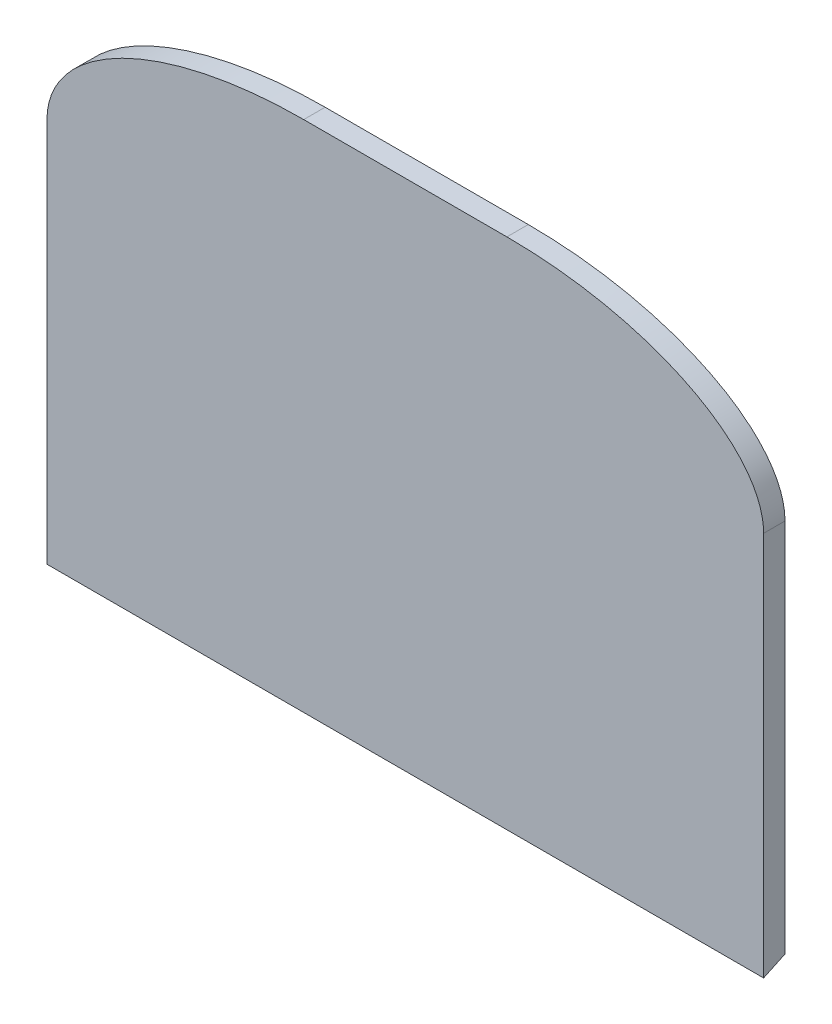
ISO-10303-21;
HEADER;
FILE_DESCRIPTION(('STEP AP214'),'2;1');
FILE_NAME('part.step','',(''),(''),'','','');
FILE_SCHEMA(('AUTOMOTIVE_DESIGN { 1 0 10303 214 1 1 1 1 }'));
ENDSEC;
DATA;
#1=APPLICATION_CONTEXT('core data for automotive mechanical design processes');
#2=APPLICATION_PROTOCOL_DEFINITION('international standard','automotive_design',2000,#1);
#3=PRODUCT_CONTEXT('',#1,'mechanical');
#4=PRODUCT('Part','Part','',(#3));
#5=PRODUCT_RELATED_PRODUCT_CATEGORY('part','',(#4));
#6=PRODUCT_DEFINITION_FORMATION('','',#4);
#7=PRODUCT_DEFINITION_CONTEXT('part definition',#1,'design');
#8=PRODUCT_DEFINITION('design','',#6,#7);
#9=PRODUCT_DEFINITION_SHAPE('','',#8);
#10=(LENGTH_UNIT() NAMED_UNIT(*) SI_UNIT(.MILLI.,.METRE.));
#11=(NAMED_UNIT(*) PLANE_ANGLE_UNIT() SI_UNIT($,.RADIAN.));
#12=(NAMED_UNIT(*) SI_UNIT($,.STERADIAN.) SOLID_ANGLE_UNIT());
#13=UNCERTAINTY_MEASURE_WITH_UNIT(LENGTH_MEASURE(1.E-05),#10,'distance_accuracy_value','');
#14=(GEOMETRIC_REPRESENTATION_CONTEXT(3) GLOBAL_UNCERTAINTY_ASSIGNED_CONTEXT((#13)) GLOBAL_UNIT_ASSIGNED_CONTEXT((#10,
#11,#12)) REPRESENTATION_CONTEXT('',''));
#15=CARTESIAN_POINT('',(0.,0.,0.));
#16=DIRECTION('',(0.,0.,1.));
#17=DIRECTION('',(1.,0.,0.));
#18=AXIS2_PLACEMENT_3D('',#15,#16,#17);
#19=CARTESIAN_POINT('',(517.764468596395,222.024281538796,0.));
#20=DIRECTION('',(0.,0.,1.));
#21=DIRECTION('',(1.,0.,0.));
#22=AXIS2_PLACEMENT_3D('',#19,#20,#21);
#23=PLANE('',#22);
#24=DIRECTION('',(0.,1.,0.));
#25=VECTOR('',#24,1.);
#26=CARTESIAN_POINT('',(-212.7,222.024281538794,0.));
#27=LINE('',#26,#25);
#28=CARTESIAN_POINT('',(-212.7,222.024281538796,0.));
#29=VERTEX_POINT('',#28);
#30=CARTESIAN_POINT('',(-212.699999999999,444.630449238084,0.));
#31=VERTEX_POINT('',#30);
#32=EDGE_CURVE('E125',#29,#31,#27,.T.);
#33=ORIENTED_EDGE('',*,*,#32,.T.);
#34=CARTESIAN_POINT('',(-60.2999999999985,520.830449238083,-2.16108598030673E-13));
#35=CARTESIAN_POINT('',(-212.699999999998,520.830449238083,2.187626382253E-13));
#36=CARTESIAN_POINT('',(-212.699999999999,444.630449238084,2.18358317538581E-13));
#37=(BOUNDED_CURVE() B_SPLINE_CURVE(2,(#34,#35,#36),.UNSPECIFIED.,.F.,
.F.) B_SPLINE_CURVE_WITH_KNOTS((3,3),(0.,1.),
.UNSPECIFIED.) CURVE() GEOMETRIC_REPRESENTATION_ITEM() RATIONAL_B_SPLINE_CURVE((1.,
0.70710678118655,1.)) REPRESENTATION_ITEM(''));
#38=CARTESIAN_POINT('',(-60.2999999999985,520.830449238083,0.));
#39=VERTEX_POINT('',#38);
#40=EDGE_CURVE('E56',#31,#39,#37,.F.);
#41=ORIENTED_EDGE('',*,*,#40,.T.);
#42=DIRECTION('',(-1.,0.,0.));
#43=VECTOR('',#42,1.);
#44=CARTESIAN_POINT('',(517.764468596395,520.830449238083,0.));
#45=LINE('',#44,#43);
#46=CARTESIAN_POINT('',(60.3000000000014,520.830449238083,0.));
#47=VERTEX_POINT('',#46);
#48=EDGE_CURVE('E127',#47,#39,#45,.T.);
#49=ORIENTED_EDGE('',*,*,#48,.F.);
#50=CARTESIAN_POINT('',(212.700000000001,444.630449238082,-2.1670490922554E-13));
#51=CARTESIAN_POINT('',(212.700000000002,520.830449238083,-2.16884353789864E-13));
#52=CARTESIAN_POINT('',(60.3000000000014,520.830449238083,2.18819103461887E-13));
#53=(BOUNDED_CURVE() B_SPLINE_CURVE(2,(#50,#51,#52),.UNSPECIFIED.,.F.,
.F.) B_SPLINE_CURVE_WITH_KNOTS((3,3),(0.,1.),
.UNSPECIFIED.) CURVE() GEOMETRIC_REPRESENTATION_ITEM() RATIONAL_B_SPLINE_CURVE((1.,
0.707106781186545,1.)) REPRESENTATION_ITEM(''));
#54=CARTESIAN_POINT('',(212.700000000001,444.630449238082,0.));
#55=VERTEX_POINT('',#54);
#56=EDGE_CURVE('E63',#47,#55,#53,.F.);
#57=ORIENTED_EDGE('',*,*,#56,.T.);
#58=DIRECTION('',(0.,-1.,0.));
#59=VECTOR('',#58,1.);
#60=CARTESIAN_POINT('',(212.7,222.024281538798,0.));
#61=LINE('',#60,#59);
#62=CARTESIAN_POINT('',(212.700000000001,222.024281538796,0.));
#63=VERTEX_POINT('',#62);
#64=EDGE_CURVE('E135',#55,#63,#61,.T.);
#65=ORIENTED_EDGE('',*,*,#64,.T.);
#66=DIRECTION('',(-1.,0.,0.));
#67=VECTOR('',#66,1.);
#68=CARTESIAN_POINT('',(517.764468596395,222.024281538796,0.));
#69=LINE('',#68,#67);
#70=EDGE_CURVE('E122',#63,#29,#69,.T.);
#71=ORIENTED_EDGE('',*,*,#70,.T.);
#72=EDGE_LOOP('',(#33,#41,#49,#57,#65,#71));
#73=FACE_BOUND('',#72,.T.);
#74=ADVANCED_FACE('F42',(#73),#23,.F.);
#75=CARTESIAN_POINT('',(517.764468596395,222.024281538796,0.));
#76=DIRECTION('',(0.,0.904341830523688,0.426808919266064));
#77=DIRECTION('',(0.,-0.426808919266064,0.904341830523688));
#78=AXIS2_PLACEMENT_3D('',#75,#76,#77);
#79=PLANE('',#78);
#80=ORIENTED_EDGE('',*,*,#70,.F.);
#81=DIRECTION('',(0.,-0.426808919266064,0.904341830523688));
#82=VECTOR('',#81,1.);
#83=CARTESIAN_POINT('',(212.7,222.024281538796,0.));
#84=LINE('',#83,#82);
#85=CARTESIAN_POINT('',(212.7,216.030449238083,12.7));
#86=VERTEX_POINT('',#85);
#87=EDGE_CURVE('E120',#63,#86,#84,.T.);
#88=ORIENTED_EDGE('',*,*,#87,.T.);
#89=DIRECTION('',(-1.,0.,0.));
#90=VECTOR('',#89,1.);
#91=CARTESIAN_POINT('',(517.764468596395,216.030449238083,12.7));
#92=LINE('',#91,#90);
#93=CARTESIAN_POINT('',(-212.699999999999,216.030449238083,12.7));
#94=VERTEX_POINT('',#93);
#95=EDGE_CURVE('E108',#86,#94,#92,.T.);
#96=ORIENTED_EDGE('',*,*,#95,.T.);
#97=DIRECTION('',(0.,0.426808919266064,-0.904341830523688));
#98=VECTOR('',#97,1.);
#99=CARTESIAN_POINT('',(-212.7,222.024281538796,0.));
#100=LINE('',#99,#98);
#101=EDGE_CURVE('E113',#94,#29,#100,.T.);
#102=ORIENTED_EDGE('',*,*,#101,.T.);
#103=EDGE_LOOP('',(#80,#88,#96,#102));
#104=FACE_BOUND('',#103,.T.);
#105=ADVANCED_FACE('F118',(#104),#79,.F.);
#106=CARTESIAN_POINT('',(517.764468596395,216.030449238083,12.7));
#107=DIRECTION('',(0.,0.,-1.));
#108=DIRECTION('',(-1.,0.,0.));
#109=AXIS2_PLACEMENT_3D('',#106,#107,#108);
#110=PLANE('',#109);
#111=DIRECTION('',(-1.,0.,0.));
#112=VECTOR('',#111,1.);
#113=CARTESIAN_POINT('',(517.764468596395,520.830449238083,12.7));
#114=LINE('',#113,#112);
#115=CARTESIAN_POINT('',(60.3000000000014,520.830449238083,12.7));
#116=VERTEX_POINT('',#115);
#117=CARTESIAN_POINT('',(-60.2999999999985,520.830449238083,12.7));
#118=VERTEX_POINT('',#117);
#119=EDGE_CURVE('E121',#116,#118,#114,.T.);
#120=ORIENTED_EDGE('',*,*,#119,.T.);
#121=CARTESIAN_POINT('',(-212.699999999998,444.630449238084,12.7000000000002));
#122=CARTESIAN_POINT('',(-212.699999999998,520.830449238083,12.7000000000002));
#123=CARTESIAN_POINT('',(-60.2999999999985,520.830449238083,12.6999999999998));
#124=(BOUNDED_CURVE() B_SPLINE_CURVE(2,(#121,#122,#123),.UNSPECIFIED.,.F.,
.F.) B_SPLINE_CURVE_WITH_KNOTS((3,3),(0.,1.),
.UNSPECIFIED.) CURVE() GEOMETRIC_REPRESENTATION_ITEM() RATIONAL_B_SPLINE_CURVE((1.,
0.70710678118655,1.)) REPRESENTATION_ITEM(''));
#125=CARTESIAN_POINT('',(-212.699999999999,444.630449238084,12.7));
#126=VERTEX_POINT('',#125);
#127=EDGE_CURVE('E110',#118,#126,#124,.F.);
#128=ORIENTED_EDGE('',*,*,#127,.T.);
#129=DIRECTION('',(0.,-1.,0.));
#130=VECTOR('',#129,1.);
#131=CARTESIAN_POINT('',(-212.7,216.030449238081,12.7));
#132=LINE('',#131,#130);
#133=EDGE_CURVE('E103',#126,#94,#132,.T.);
#134=ORIENTED_EDGE('',*,*,#133,.T.);
#135=ORIENTED_EDGE('',*,*,#95,.F.);
#136=DIRECTION('',(0.,1.,0.));
#137=VECTOR('',#136,1.);
#138=CARTESIAN_POINT('',(212.7,216.030449238085,12.7));
#139=LINE('',#138,#137);
#140=CARTESIAN_POINT('',(212.700000000001,444.630449238082,12.7));
#141=VERTEX_POINT('',#140);
#142=EDGE_CURVE('E134',#86,#141,#139,.T.);
#143=ORIENTED_EDGE('',*,*,#142,.T.);
#144=CARTESIAN_POINT('',(60.3000000000014,520.830449238083,12.7000000000002));
#145=CARTESIAN_POINT('',(212.700000000002,520.830449238083,12.6999999999998));
#146=CARTESIAN_POINT('',(212.700000000001,444.630449238082,12.6999999999998));
#147=(BOUNDED_CURVE() B_SPLINE_CURVE(2,(#144,#145,#146),.UNSPECIFIED.,.F.,
.F.) B_SPLINE_CURVE_WITH_KNOTS((3,3),(0.,1.),
.UNSPECIFIED.) CURVE() GEOMETRIC_REPRESENTATION_ITEM() RATIONAL_B_SPLINE_CURVE((1.,
0.707106781186545,1.)) REPRESENTATION_ITEM(''));
#148=EDGE_CURVE('E151',#141,#116,#147,.F.);
#149=ORIENTED_EDGE('',*,*,#148,.T.);
#150=EDGE_LOOP('',(#120,#128,#134,#135,#143,#149));
#151=FACE_BOUND('',#150,.T.);
#152=ADVANCED_FACE('F106',(#151),#110,.F.);
#153=CARTESIAN_POINT('',(517.764468596395,520.830449238083,12.7));
#154=DIRECTION('',(0.,-1.,0.));
#155=DIRECTION('',(0.,0.,-1.));
#156=AXIS2_PLACEMENT_3D('',#153,#154,#155);
#157=PLANE('',#156);
#158=ORIENTED_EDGE('',*,*,#48,.T.);
#159=CARTESIAN_POINT('',(-60.2999999999985,520.830449238083,13.335));
#160=CARTESIAN_POINT('',(-60.2999999999985,520.830449238083,8.67833333333319));
#161=CARTESIAN_POINT('',(-60.2999999999985,520.830449238083,4.02166666666637));
#162=CARTESIAN_POINT('',(-60.2999999999985,520.830449238083,-0.63500000000046));
#163=(BOUNDED_CURVE() B_SPLINE_CURVE(3,(#159,#160,#161,#162),.UNSPECIFIED.,.F.,
.F.) B_SPLINE_CURVE_WITH_KNOTS((4,4),(-0.00063499999999837,0.0133350000000021),
.UNSPECIFIED.) CURVE() GEOMETRIC_REPRESENTATION_ITEM() RATIONAL_B_SPLINE_CURVE((1.,1.,1.,1.)) REPRESENTATION_ITEM(''));
#164=EDGE_CURVE('E295',#39,#118,#163,.F.);
#165=ORIENTED_EDGE('',*,*,#164,.T.);
#166=ORIENTED_EDGE('',*,*,#119,.F.);
#167=CARTESIAN_POINT('',(60.3000000000014,520.830449238083,-0.635000000000024));
#168=CARTESIAN_POINT('',(60.3000000000014,520.830449238083,4.0216666666668));
#169=CARTESIAN_POINT('',(60.3000000000014,520.830449238083,8.67833333333363));
#170=CARTESIAN_POINT('',(60.3000000000014,520.830449238083,13.3350000000005));
#171=(BOUNDED_CURVE() B_SPLINE_CURVE(3,(#167,#168,#169,#170),.UNSPECIFIED.,.F.,
.F.) B_SPLINE_CURVE_WITH_KNOTS((4,4),(-0.00063499999999915,0.0133350000000013),
.UNSPECIFIED.) CURVE() GEOMETRIC_REPRESENTATION_ITEM() RATIONAL_B_SPLINE_CURVE((1.,1.,1.,1.)) REPRESENTATION_ITEM(''));
#172=EDGE_CURVE('E142',#116,#47,#171,.F.);
#173=ORIENTED_EDGE('',*,*,#172,.T.);
#174=EDGE_LOOP('',(#158,#165,#166,#173));
#175=FACE_BOUND('',#174,.T.);
#176=ADVANCED_FACE('F165',(#175),#157,.F.);
#177=CARTESIAN_POINT('',(212.7,203.12405081555,-12.0258282306878));
#178=DIRECTION('',(-1.,0.,0.));
#179=DIRECTION('',(0.,-0.426808919266064,0.904341830523688));
#180=AXIS2_PLACEMENT_3D('',#177,#178,#179);
#181=PLANE('',#180);
#182=ORIENTED_EDGE('',*,*,#64,.F.);
#183=CARTESIAN_POINT('',(212.700000000001,444.630449238082,13.335));
#184=CARTESIAN_POINT('',(212.700000000001,444.630449238082,8.67833333333319));
#185=CARTESIAN_POINT('',(212.700000000001,444.630449238082,4.02166666666637));
#186=CARTESIAN_POINT('',(212.700000000001,444.630449238082,-0.63500000000046));
#187=(BOUNDED_CURVE() B_SPLINE_CURVE(3,(#183,#184,#185,#186),.UNSPECIFIED.,.F.,
.F.) B_SPLINE_CURVE_WITH_KNOTS((4,4),(-0.000634999999999149,0.0133350000000013),
.UNSPECIFIED.) CURVE() GEOMETRIC_REPRESENTATION_ITEM() RATIONAL_B_SPLINE_CURVE((1.,1.,1.,1.)) REPRESENTATION_ITEM(''));
#188=EDGE_CURVE('E12',#55,#141,#187,.F.);
#189=ORIENTED_EDGE('',*,*,#188,.T.);
#190=ORIENTED_EDGE('',*,*,#142,.F.);
#191=ORIENTED_EDGE('',*,*,#87,.F.);
#192=EDGE_LOOP('',(#182,#189,#190,#191));
#193=FACE_BOUND('',#192,.T.);
#194=ADVANCED_FACE('F191',(#193),#181,.F.);
#195=CARTESIAN_POINT('',(-212.7,203.12405081555,-12.0258282306877));
#196=DIRECTION('',(-1.,0.,0.));
#197=DIRECTION('',(0.,-0.426808919266064,0.904341830523688));
#198=AXIS2_PLACEMENT_3D('',#195,#196,#197);
#199=PLANE('',#198);
#200=ORIENTED_EDGE('',*,*,#133,.F.);
#201=CARTESIAN_POINT('',(-212.699999999999,444.630449238084,-0.635000000000024));
#202=CARTESIAN_POINT('',(-212.699999999999,444.630449238084,4.0216666666668));
#203=CARTESIAN_POINT('',(-212.699999999998,444.630449238084,8.67833333333363));
#204=CARTESIAN_POINT('',(-212.699999999998,444.630449238084,13.3350000000005));
#205=(BOUNDED_CURVE() B_SPLINE_CURVE(3,(#201,#202,#203,#204),.UNSPECIFIED.,.F.,
.F.) B_SPLINE_CURVE_WITH_KNOTS((4,4),(-0.00063499999999837,0.0133350000000021),
.UNSPECIFIED.) CURVE() GEOMETRIC_REPRESENTATION_ITEM() RATIONAL_B_SPLINE_CURVE((1.,1.,1.,1.)) REPRESENTATION_ITEM(''));
#206=EDGE_CURVE('E72',#126,#31,#205,.F.);
#207=ORIENTED_EDGE('',*,*,#206,.T.);
#208=ORIENTED_EDGE('',*,*,#32,.F.);
#209=ORIENTED_EDGE('',*,*,#101,.F.);
#210=EDGE_LOOP('',(#200,#207,#208,#209));
#211=FACE_BOUND('',#210,.T.);
#212=ADVANCED_FACE('F124',(#211),#199,.T.);
#213=CARTESIAN_POINT('',(-212.699999999998,444.630449238084,13.3350000000005));
#214=CARTESIAN_POINT('',(-212.699999999998,444.630449238084,8.67833333333363));
#215=CARTESIAN_POINT('',(-212.699999999999,444.630449238084,4.0216666666668));
#216=CARTESIAN_POINT('',(-212.699999999999,444.630449238084,-0.635000000000024));
#217=CARTESIAN_POINT('',(-212.699999999998,520.830449238083,13.3350000000005));
#218=CARTESIAN_POINT('',(-212.699999999998,520.830449238083,8.67833333333363));
#219=CARTESIAN_POINT('',(-212.699999999998,520.830449238083,4.0216666666668));
#220=CARTESIAN_POINT('',(-212.699999999998,520.830449238083,-0.635000000000024));
#221=CARTESIAN_POINT('',(-60.2999999999985,520.830449238083,13.335));
#222=CARTESIAN_POINT('',(-60.2999999999985,520.830449238083,8.67833333333319));
#223=CARTESIAN_POINT('',(-60.2999999999985,520.830449238083,4.02166666666637));
#224=CARTESIAN_POINT('',(-60.2999999999985,520.830449238083,-0.63500000000046));
#225=(BOUNDED_SURFACE() B_SPLINE_SURFACE(2,3,((#213,#214,#215,#216),(#217,#218,#219,#220),(#221,
#222,#223,#224)),.UNSPECIFIED.,.F.,.F.,.F.) B_SPLINE_SURFACE_WITH_KNOTS((3,3),(4,4),(0.,1.),
(-0.00063499999999837,0.0133350000000021),
.UNSPECIFIED.) GEOMETRIC_REPRESENTATION_ITEM() RATIONAL_B_SPLINE_SURFACE(((1.,1.,1.,1.),
(0.70710678118655,0.70710678118655,0.70710678118655,0.70710678118655),(1.,1.,1.,1.))) REPRESENTATION_ITEM('') SURFACE());
#226=ORIENTED_EDGE('',*,*,#40,.F.);
#227=ORIENTED_EDGE('',*,*,#206,.F.);
#228=ORIENTED_EDGE('',*,*,#127,.F.);
#229=ORIENTED_EDGE('',*,*,#164,.F.);
#230=EDGE_LOOP('',(#226,#227,#228,#229));
#231=FACE_BOUND('',#230,.T.);
#232=ADVANCED_FACE('F190',(#231),#225,.T.);
#233=CARTESIAN_POINT('',(60.3000000000014,520.830449238083,13.3350000000005));
#234=CARTESIAN_POINT('',(60.3000000000014,520.830449238083,8.67833333333363));
#235=CARTESIAN_POINT('',(60.3000000000014,520.830449238083,4.0216666666668));
#236=CARTESIAN_POINT('',(60.3000000000014,520.830449238083,-0.635000000000024));
#237=CARTESIAN_POINT('',(212.700000000002,520.830449238083,13.335));
#238=CARTESIAN_POINT('',(212.700000000002,520.830449238083,8.6783333333332));
#239=CARTESIAN_POINT('',(212.700000000002,520.830449238083,4.02166666666637));
#240=CARTESIAN_POINT('',(212.700000000002,520.830449238083,-0.63500000000046));
#241=CARTESIAN_POINT('',(212.700000000001,444.630449238082,13.335));
#242=CARTESIAN_POINT('',(212.700000000001,444.630449238082,8.67833333333319));
#243=CARTESIAN_POINT('',(212.700000000001,444.630449238082,4.02166666666637));
#244=CARTESIAN_POINT('',(212.700000000001,444.630449238082,-0.63500000000046));
#245=(BOUNDED_SURFACE() B_SPLINE_SURFACE(2,3,((#233,#234,#235,#236),(#237,#238,#239,#240),(#241,
#242,#243,#244)),.UNSPECIFIED.,.F.,.F.,.F.) B_SPLINE_SURFACE_WITH_KNOTS((3,3),(4,4),(0.,1.),
(-0.000634999999999149,0.0133350000000013),
.UNSPECIFIED.) GEOMETRIC_REPRESENTATION_ITEM() RATIONAL_B_SPLINE_SURFACE(((1.,1.,1.,1.),
(0.707106781186545,0.707106781186545,0.707106781186545,0.707106781186545),(1.,1.,1.,1.))) REPRESENTATION_ITEM('') SURFACE());
#246=ORIENTED_EDGE('',*,*,#148,.F.);
#247=ORIENTED_EDGE('',*,*,#188,.F.);
#248=ORIENTED_EDGE('',*,*,#56,.F.);
#249=ORIENTED_EDGE('',*,*,#172,.F.);
#250=EDGE_LOOP('',(#246,#247,#248,#249));
#251=FACE_BOUND('',#250,.T.);
#252=ADVANCED_FACE('F45',(#251),#245,.T.);
#253=CLOSED_SHELL('',(#74,#105,#152,#176,#194,#212,#232,#252));
#254=MANIFOLD_SOLID_BREP('B2',#253);
#255=ADVANCED_BREP_SHAPE_REPRESENTATION('',(#18,#254),#14);
#256=SHAPE_DEFINITION_REPRESENTATION(#9,#255);
ENDSEC;
END-ISO-10303-21;
